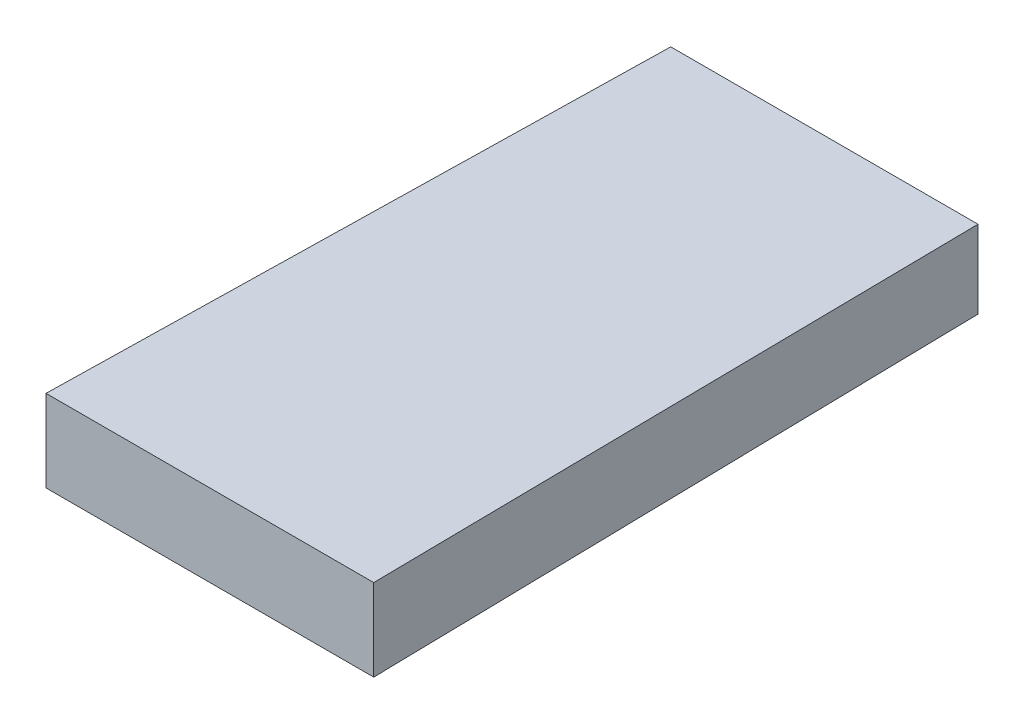
ISO-10303-21;
HEADER;
FILE_DESCRIPTION(('STEP AP214'),'2;1');
FILE_NAME('part.step','',(''),(''),'','','');
FILE_SCHEMA(('AUTOMOTIVE_DESIGN { 1 0 10303 214 1 1 1 1 }'));
ENDSEC;
DATA;
#1=APPLICATION_CONTEXT('core data for automotive mechanical design processes');
#2=APPLICATION_PROTOCOL_DEFINITION('international standard','automotive_design',2000,#1);
#3=PRODUCT_CONTEXT('',#1,'mechanical');
#4=PRODUCT('Part','Part','',(#3));
#5=PRODUCT_RELATED_PRODUCT_CATEGORY('part','',(#4));
#6=PRODUCT_DEFINITION_FORMATION('','',#4);
#7=PRODUCT_DEFINITION_CONTEXT('part definition',#1,'design');
#8=PRODUCT_DEFINITION('design','',#6,#7);
#9=PRODUCT_DEFINITION_SHAPE('','',#8);
#10=(LENGTH_UNIT() NAMED_UNIT(*) SI_UNIT(.MILLI.,.METRE.));
#11=(NAMED_UNIT(*) PLANE_ANGLE_UNIT() SI_UNIT($,.RADIAN.));
#12=(NAMED_UNIT(*) SI_UNIT($,.STERADIAN.) SOLID_ANGLE_UNIT());
#13=UNCERTAINTY_MEASURE_WITH_UNIT(LENGTH_MEASURE(1.E-05),#10,'distance_accuracy_value','');
#14=(GEOMETRIC_REPRESENTATION_CONTEXT(3) GLOBAL_UNCERTAINTY_ASSIGNED_CONTEXT((#13)) GLOBAL_UNIT_ASSIGNED_CONTEXT((#10,
#11,#12)) REPRESENTATION_CONTEXT('',''));
#15=CARTESIAN_POINT('',(0.,0.,0.));
#16=DIRECTION('',(0.,0.,1.));
#17=DIRECTION('',(1.,0.,0.));
#18=AXIS2_PLACEMENT_3D('',#15,#16,#17);
#19=CARTESIAN_POINT('',(0.,0.,300.));
#20=DIRECTION('',(0.,0.,1.));
#21=DIRECTION('',(1.,0.,0.));
#22=AXIS2_PLACEMENT_3D('',#19,#20,#21);
#23=PLANE('',#22);
#24=DIRECTION('',(0.,1.,0.));
#25=VECTOR('',#24,1.);
#26=CARTESIAN_POINT('',(80.,20.,300.));
#27=LINE('',#26,#25);
#28=CARTESIAN_POINT('',(80.,-20.,300.));
#29=VERTEX_POINT('',#28);
#30=CARTESIAN_POINT('',(80.,20.,300.));
#31=VERTEX_POINT('',#30);
#32=EDGE_CURVE('E166',#29,#31,#27,.T.);
#33=ORIENTED_EDGE('',*,*,#32,.T.);
#34=DIRECTION('',(-1.,0.,0.));
#35=VECTOR('',#34,1.);
#36=CARTESIAN_POINT('',(-80.,20.,300.));
#37=LINE('',#36,#35);
#38=CARTESIAN_POINT('',(-80.,20.,300.));
#39=VERTEX_POINT('',#38);
#40=EDGE_CURVE('E12',#31,#39,#37,.T.);
#41=ORIENTED_EDGE('',*,*,#40,.T.);
#42=DIRECTION('',(0.,-1.,0.));
#43=VECTOR('',#42,1.);
#44=CARTESIAN_POINT('',(-80.,20.,300.));
#45=LINE('',#44,#43);
#46=CARTESIAN_POINT('',(-80.,-20.,300.));
#47=VERTEX_POINT('',#46);
#48=EDGE_CURVE('E57',#39,#47,#45,.T.);
#49=ORIENTED_EDGE('',*,*,#48,.T.);
#50=DIRECTION('',(1.,0.,0.));
#51=VECTOR('',#50,1.);
#52=CARTESIAN_POINT('',(-80.,-20.,300.));
#53=LINE('',#52,#51);
#54=EDGE_CURVE('E186',#47,#29,#53,.T.);
#55=ORIENTED_EDGE('',*,*,#54,.T.);
#56=EDGE_LOOP('',(#33,#41,#49,#55));
#57=FACE_BOUND('',#56,.T.);
#58=ADVANCED_FACE('F47',(#57),#23,.T.);
#59=CARTESIAN_POINT('',(0.,0.,0.));
#60=DIRECTION('',(0.,0.,1.));
#61=DIRECTION('',(1.,0.,0.));
#62=AXIS2_PLACEMENT_3D('',#59,#60,#61);
#63=PLANE('',#62);
#64=DIRECTION('',(0.,1.,0.));
#65=VECTOR('',#64,1.);
#66=CARTESIAN_POINT('',(75.,19.,0.));
#67=LINE('',#66,#65);
#68=CARTESIAN_POINT('',(75.,-19.,0.));
#69=VERTEX_POINT('',#68);
#70=CARTESIAN_POINT('',(75.,19.,0.));
#71=VERTEX_POINT('',#70);
#72=EDGE_CURVE('E154',#69,#71,#67,.T.);
#73=ORIENTED_EDGE('',*,*,#72,.F.);
#74=DIRECTION('',(1.,0.,0.));
#75=VECTOR('',#74,1.);
#76=CARTESIAN_POINT('',(-75.,-19.,0.));
#77=LINE('',#76,#75);
#78=CARTESIAN_POINT('',(-75.,-19.,0.));
#79=VERTEX_POINT('',#78);
#80=EDGE_CURVE('E115',#79,#69,#77,.T.);
#81=ORIENTED_EDGE('',*,*,#80,.F.);
#82=DIRECTION('',(0.,-1.,0.));
#83=VECTOR('',#82,1.);
#84=CARTESIAN_POINT('',(-75.,19.,0.));
#85=LINE('',#84,#83);
#86=CARTESIAN_POINT('',(-75.,19.,0.));
#87=VERTEX_POINT('',#86);
#88=EDGE_CURVE('E96',#87,#79,#85,.T.);
#89=ORIENTED_EDGE('',*,*,#88,.F.);
#90=DIRECTION('',(-1.,0.,0.));
#91=VECTOR('',#90,1.);
#92=CARTESIAN_POINT('',(-75.,19.,0.));
#93=LINE('',#92,#91);
#94=EDGE_CURVE('E104',#71,#87,#93,.T.);
#95=ORIENTED_EDGE('',*,*,#94,.F.);
#96=EDGE_LOOP('',(#73,#81,#89,#95));
#97=FACE_BOUND('',#96,.T.);
#98=ADVANCED_FACE('F114',(#97),#63,.F.);
#99=CARTESIAN_POINT('',(-74.9791724520967,0.,-1.24965287420161));
#100=DIRECTION('',(0.9998611400396,0.,0.0166643523339933));
#101=DIRECTION('',(0.0166643523339933,0.,-0.9998611400396));
#102=AXIS2_PLACEMENT_3D('',#99,#100,#101);
#103=PLANE('',#102);
#104=DIRECTION('',(-0.0166642597807386,-0.00333285195614773,0.999855586844319));
#105=VECTOR('',#104,1.);
#106=CARTESIAN_POINT('',(-75.,-19.,0.));
#107=LINE('',#106,#105);
#108=EDGE_CURVE('E102',#79,#47,#107,.T.);
#109=ORIENTED_EDGE('',*,*,#108,.T.);
#110=ORIENTED_EDGE('',*,*,#48,.F.);
#111=DIRECTION('',(-0.0166642597807387,0.00333285195614773,0.999855586844319));
#112=VECTOR('',#111,1.);
#113=CARTESIAN_POINT('',(-75.,19.,0.));
#114=LINE('',#113,#112);
#115=EDGE_CURVE('E91',#87,#39,#114,.T.);
#116=ORIENTED_EDGE('',*,*,#115,.F.);
#117=ORIENTED_EDGE('',*,*,#88,.T.);
#118=EDGE_LOOP('',(#109,#110,#116,#117));
#119=FACE_BOUND('',#118,.T.);
#120=ADVANCED_FACE('F94',(#119),#103,.F.);
#121=CARTESIAN_POINT('',(0.,18.9997888912345,-0.0633326296374485));
#122=DIRECTION('',(0.,-0.99999444449074,0.00333331481496914));
#123=DIRECTION('',(0.,-0.00333331481496914,-0.99999444449074));
#124=AXIS2_PLACEMENT_3D('',#121,#122,#123);
#125=PLANE('',#124);
#126=ORIENTED_EDGE('',*,*,#115,.T.);
#127=ORIENTED_EDGE('',*,*,#40,.F.);
#128=DIRECTION('',(0.0166642597807387,0.00333285195614773,0.999855586844319));
#129=VECTOR('',#128,1.);
#130=CARTESIAN_POINT('',(75.,19.,0.));
#131=LINE('',#130,#129);
#132=EDGE_CURVE('E65',#71,#31,#131,.T.);
#133=ORIENTED_EDGE('',*,*,#132,.F.);
#134=ORIENTED_EDGE('',*,*,#94,.T.);
#135=EDGE_LOOP('',(#126,#127,#133,#134));
#136=FACE_BOUND('',#135,.T.);
#137=ADVANCED_FACE('F106',(#136),#125,.F.);
#138=CARTESIAN_POINT('',(0.,-18.9997888912345,-0.0633326296374485));
#139=DIRECTION('',(0.,0.99999444449074,0.00333331481496914));
#140=DIRECTION('',(0.,-0.00333331481496914,0.99999444449074));
#141=AXIS2_PLACEMENT_3D('',#138,#139,#140);
#142=PLANE('',#141);
#143=DIRECTION('',(0.0166642597807387,-0.00333285195614773,0.999855586844319));
#144=VECTOR('',#143,1.);
#145=CARTESIAN_POINT('',(75.,-19.,0.));
#146=LINE('',#145,#144);
#147=EDGE_CURVE('E101',#69,#29,#146,.T.);
#148=ORIENTED_EDGE('',*,*,#147,.T.);
#149=ORIENTED_EDGE('',*,*,#54,.F.);
#150=ORIENTED_EDGE('',*,*,#108,.F.);
#151=ORIENTED_EDGE('',*,*,#80,.T.);
#152=EDGE_LOOP('',(#148,#149,#150,#151));
#153=FACE_BOUND('',#152,.T.);
#154=ADVANCED_FACE('F219',(#153),#142,.F.);
#155=CARTESIAN_POINT('',(74.9791724520966,0.,-1.24965287420161));
#156=DIRECTION('',(-0.9998611400396,0.,0.0166643523339934));
#157=DIRECTION('',(0.0166643523339934,0.,0.9998611400396));
#158=AXIS2_PLACEMENT_3D('',#155,#156,#157);
#159=PLANE('',#158);
#160=ORIENTED_EDGE('',*,*,#132,.T.);
#161=ORIENTED_EDGE('',*,*,#32,.F.);
#162=ORIENTED_EDGE('',*,*,#147,.F.);
#163=ORIENTED_EDGE('',*,*,#72,.T.);
#164=EDGE_LOOP('',(#160,#161,#162,#163));
#165=FACE_BOUND('',#164,.T.);
#166=ADVANCED_FACE('F227',(#165),#159,.F.);
#167=CLOSED_SHELL('',(#58,#98,#120,#137,#154,#166));
#168=MANIFOLD_SOLID_BREP('B2',#167);
#169=ADVANCED_BREP_SHAPE_REPRESENTATION('',(#18,#168),#14);
#170=SHAPE_DEFINITION_REPRESENTATION(#9,#169);
ENDSEC;
END-ISO-10303-21;
